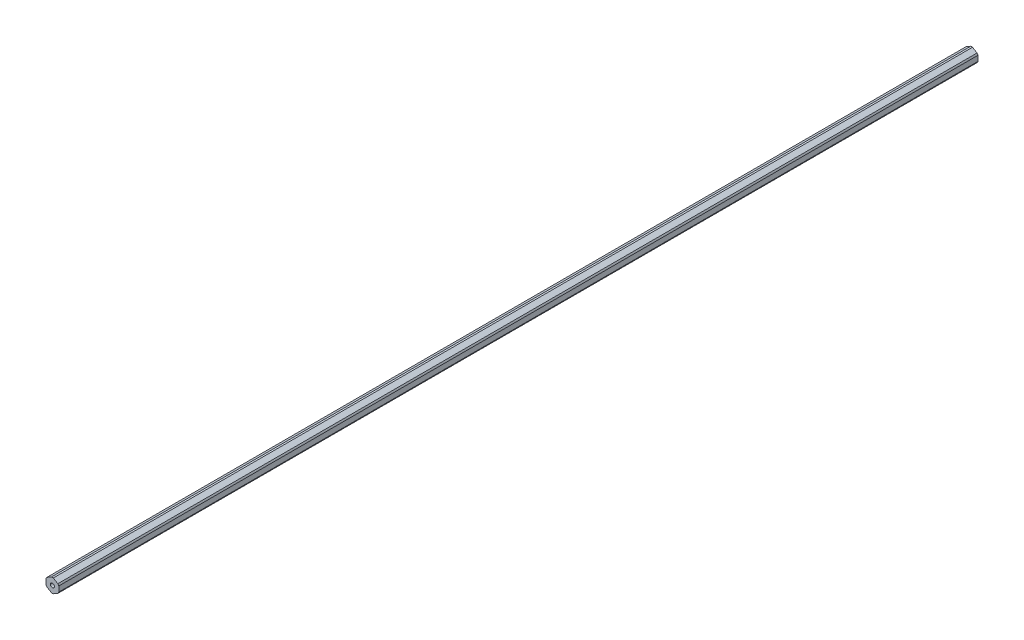
ISO-10303-21;
HEADER;
FILE_DESCRIPTION(('STEP AP214'),'2;1');
FILE_NAME('part.step','',(''),(''),'','','');
FILE_SCHEMA(('AUTOMOTIVE_DESIGN { 1 0 10303 214 1 1 1 1 }'));
ENDSEC;
DATA;
#1=APPLICATION_CONTEXT('core data for automotive mechanical design processes');
#2=APPLICATION_PROTOCOL_DEFINITION('international standard','automotive_design',2000,#1);
#3=PRODUCT_CONTEXT('',#1,'mechanical');
#4=PRODUCT('Part','Part','',(#3));
#5=PRODUCT_RELATED_PRODUCT_CATEGORY('part','',(#4));
#6=PRODUCT_DEFINITION_FORMATION('','',#4);
#7=PRODUCT_DEFINITION_CONTEXT('part definition',#1,'design');
#8=PRODUCT_DEFINITION('design','',#6,#7);
#9=PRODUCT_DEFINITION_SHAPE('','',#8);
#10=(LENGTH_UNIT() NAMED_UNIT(*) SI_UNIT(.MILLI.,.METRE.));
#11=(NAMED_UNIT(*) PLANE_ANGLE_UNIT() SI_UNIT($,.RADIAN.));
#12=(NAMED_UNIT(*) SI_UNIT($,.STERADIAN.) SOLID_ANGLE_UNIT());
#13=UNCERTAINTY_MEASURE_WITH_UNIT(LENGTH_MEASURE(1.E-05),#10,'distance_accuracy_value','');
#14=(GEOMETRIC_REPRESENTATION_CONTEXT(3) GLOBAL_UNCERTAINTY_ASSIGNED_CONTEXT((#13)) GLOBAL_UNIT_ASSIGNED_CONTEXT((#10,
#11,#12)) REPRESENTATION_CONTEXT('',''));
#15=CARTESIAN_POINT('',(0.,0.,0.));
#16=DIRECTION('',(0.,0.,1.));
#17=DIRECTION('',(1.,0.,0.));
#18=AXIS2_PLACEMENT_3D('',#15,#16,#17);
#19=CARTESIAN_POINT('',(0.,0.,-457.2));
#20=DIRECTION('',(0.,0.,1.));
#21=DIRECTION('',(1.,0.,0.));
#22=AXIS2_PLACEMENT_3D('',#19,#20,#21);
#23=PLANE('',#22);
#24=CARTESIAN_POINT('',(0.,0.,-457.2));
#25=DIRECTION('',(0.,0.,1.));
#26=DIRECTION('',(1.,0.,0.));
#27=AXIS2_PLACEMENT_3D('',#24,#25,#26);
#28=CIRCLE('',#27,2.0193);
#29=CARTESIAN_POINT('',(-2.0193,0.,-457.2));
#30=VERTEX_POINT('',#29);
#31=CARTESIAN_POINT('',(2.0193,0.,-457.2));
#32=VERTEX_POINT('',#31);
#33=EDGE_CURVE('E172',#30,#32,#28,.T.);
#34=ORIENTED_EDGE('',*,*,#33,.T.);
#35=CARTESIAN_POINT('',(0.,0.,-457.2));
#36=DIRECTION('',(0.,0.,1.));
#37=DIRECTION('',(1.,0.,0.));
#38=AXIS2_PLACEMENT_3D('',#35,#36,#37);
#39=CIRCLE('',#38,2.0193);
#40=EDGE_CURVE('E163',#32,#30,#39,.T.);
#41=ORIENTED_EDGE('',*,*,#40,.T.);
#42=EDGE_LOOP('',(#34,#41));
#43=FACE_BOUND('',#42,.T.);
#44=DIRECTION('',(0.,1.,0.));
#45=VECTOR('',#44,1.);
#46=CARTESIAN_POINT('',(6.345,0.,-457.2));
#47=LINE('',#46,#45);
#48=CARTESIAN_POINT('',(6.345,-2.63398462410091,-457.2));
#49=VERTEX_POINT('',#48);
#50=CARTESIAN_POINT('',(6.345,2.63398462410091,-457.2));
#51=VERTEX_POINT('',#50);
#52=EDGE_CURVE('E171',#49,#51,#47,.T.);
#53=ORIENTED_EDGE('',*,*,#52,.F.);
#54=CARTESIAN_POINT('',(0.,0.,-457.2));
#55=DIRECTION('',(0.,0.,1.));
#56=DIRECTION('',(1.,0.,0.));
#57=AXIS2_PLACEMENT_3D('',#54,#55,#56);
#58=CIRCLE('',#57,6.87);
#59=CARTESIAN_POINT('',(5.45359759764899,-4.17793887496181,-457.2));
#60=VERTEX_POINT('',#59);
#61=EDGE_CURVE('E26',#60,#49,#58,.T.);
#62=ORIENTED_EDGE('',*,*,#61,.F.);
#63=DIRECTION('',(0.866025403784439,0.5,0.));
#64=VECTOR('',#63,1.);
#65=CARTESIAN_POINT('',(3.1725,-5.49493118701227,-457.2));
#66=LINE('',#65,#64);
#67=CARTESIAN_POINT('',(0.891402402351008,-6.81192349906272,-457.2));
#68=VERTEX_POINT('',#67);
#69=EDGE_CURVE('E19',#68,#60,#66,.T.);
#70=ORIENTED_EDGE('',*,*,#69,.F.);
#71=CARTESIAN_POINT('',(0.,0.,-457.2));
#72=DIRECTION('',(0.,0.,1.));
#73=DIRECTION('',(1.,0.,0.));
#74=AXIS2_PLACEMENT_3D('',#71,#72,#73);
#75=CIRCLE('',#74,6.87);
#76=CARTESIAN_POINT('',(-0.891402402351014,-6.81192349906272,-457.2));
#77=VERTEX_POINT('',#76);
#78=EDGE_CURVE('E194',#77,#68,#75,.T.);
#79=ORIENTED_EDGE('',*,*,#78,.F.);
#80=DIRECTION('',(0.866025403784439,-0.5,0.));
#81=VECTOR('',#80,1.);
#82=CARTESIAN_POINT('',(-3.1725,-5.49493118701226,-457.2));
#83=LINE('',#82,#81);
#84=CARTESIAN_POINT('',(-5.45359759764899,-4.17793887496181,-457.2));
#85=VERTEX_POINT('',#84);
#86=EDGE_CURVE('E189',#85,#77,#83,.T.);
#87=ORIENTED_EDGE('',*,*,#86,.F.);
#88=CARTESIAN_POINT('',(0.,0.,-457.2));
#89=DIRECTION('',(0.,0.,1.));
#90=DIRECTION('',(1.,0.,0.));
#91=AXIS2_PLACEMENT_3D('',#88,#89,#90);
#92=CIRCLE('',#91,6.87);
#93=CARTESIAN_POINT('',(-6.345,-2.63398462410091,-457.2));
#94=VERTEX_POINT('',#93);
#95=EDGE_CURVE('E185',#94,#85,#92,.T.);
#96=ORIENTED_EDGE('',*,*,#95,.F.);
#97=DIRECTION('',(0.,-1.,0.));
#98=VECTOR('',#97,1.);
#99=CARTESIAN_POINT('',(-6.345,0.,-457.2));
#100=LINE('',#99,#98);
#101=CARTESIAN_POINT('',(-6.345,2.63398462410091,-457.2));
#102=VERTEX_POINT('',#101);
#103=EDGE_CURVE('E226',#102,#94,#100,.T.);
#104=ORIENTED_EDGE('',*,*,#103,.F.);
#105=CARTESIAN_POINT('',(0.,0.,-457.2));
#106=DIRECTION('',(0.,0.,1.));
#107=DIRECTION('',(1.,0.,0.));
#108=AXIS2_PLACEMENT_3D('',#105,#106,#107);
#109=CIRCLE('',#108,6.87);
#110=CARTESIAN_POINT('',(-5.45359759764899,4.17793887496182,-457.2));
#111=VERTEX_POINT('',#110);
#112=EDGE_CURVE('E225',#111,#102,#109,.T.);
#113=ORIENTED_EDGE('',*,*,#112,.F.);
#114=DIRECTION('',(-0.866025403784439,-0.5,0.));
#115=VECTOR('',#114,1.);
#116=CARTESIAN_POINT('',(-3.1725,5.49493118701227,-457.2));
#117=LINE('',#116,#115);
#118=CARTESIAN_POINT('',(-0.891402402351017,6.81192349906272,-457.2));
#119=VERTEX_POINT('',#118);
#120=EDGE_CURVE('E138',#119,#111,#117,.T.);
#121=ORIENTED_EDGE('',*,*,#120,.F.);
#122=CARTESIAN_POINT('',(0.,0.,-457.2));
#123=DIRECTION('',(0.,0.,1.));
#124=DIRECTION('',(1.,0.,0.));
#125=AXIS2_PLACEMENT_3D('',#122,#123,#124);
#126=CIRCLE('',#125,6.87);
#127=CARTESIAN_POINT('',(0.891402402351022,6.81192349906272,-457.2));
#128=VERTEX_POINT('',#127);
#129=EDGE_CURVE('E149',#128,#119,#126,.T.);
#130=ORIENTED_EDGE('',*,*,#129,.F.);
#131=DIRECTION('',(-0.866025403784439,0.5,0.));
#132=VECTOR('',#131,1.);
#133=CARTESIAN_POINT('',(3.1725,5.49493118701227,-457.2));
#134=LINE('',#133,#132);
#135=CARTESIAN_POINT('',(5.45359759764898,4.17793887496182,-457.2));
#136=VERTEX_POINT('',#135);
#137=EDGE_CURVE('E152',#136,#128,#134,.T.);
#138=ORIENTED_EDGE('',*,*,#137,.F.);
#139=CARTESIAN_POINT('',(0.,0.,-457.2));
#140=DIRECTION('',(0.,0.,1.));
#141=DIRECTION('',(1.,0.,0.));
#142=AXIS2_PLACEMENT_3D('',#139,#140,#141);
#143=CIRCLE('',#142,6.87);
#144=EDGE_CURVE('E219',#51,#136,#143,.T.);
#145=ORIENTED_EDGE('',*,*,#144,.F.);
#146=EDGE_LOOP('',(#53,#62,#70,#79,#87,#96,#104,#113,#121,#130,#138,#145));
#147=FACE_BOUND('',#146,.T.);
#148=ADVANCED_FACE('F15',(#43,#147),#23,.F.);
#149=CARTESIAN_POINT('',(0.,0.,457.2));
#150=DIRECTION('',(0.,0.,1.));
#151=DIRECTION('',(1.,0.,0.));
#152=AXIS2_PLACEMENT_3D('',#149,#150,#151);
#153=PLANE('',#152);
#154=CARTESIAN_POINT('',(0.,0.,457.2));
#155=DIRECTION('',(0.,0.,1.));
#156=DIRECTION('',(1.,0.,0.));
#157=AXIS2_PLACEMENT_3D('',#154,#155,#156);
#158=CIRCLE('',#157,2.0193);
#159=CARTESIAN_POINT('',(-2.0193,0.,457.2));
#160=VERTEX_POINT('',#159);
#161=CARTESIAN_POINT('',(2.0193,0.,457.2));
#162=VERTEX_POINT('',#161);
#163=EDGE_CURVE('E175',#160,#162,#158,.T.);
#164=ORIENTED_EDGE('',*,*,#163,.F.);
#165=CARTESIAN_POINT('',(0.,0.,457.2));
#166=DIRECTION('',(0.,0.,1.));
#167=DIRECTION('',(1.,0.,0.));
#168=AXIS2_PLACEMENT_3D('',#165,#166,#167);
#169=CIRCLE('',#168,2.0193);
#170=EDGE_CURVE('E303',#162,#160,#169,.T.);
#171=ORIENTED_EDGE('',*,*,#170,.F.);
#172=EDGE_LOOP('',(#164,#171));
#173=FACE_BOUND('',#172,.T.);
#174=DIRECTION('',(0.,1.,0.));
#175=VECTOR('',#174,1.);
#176=CARTESIAN_POINT('',(6.345,0.,457.2));
#177=LINE('',#176,#175);
#178=CARTESIAN_POINT('',(6.345,-2.63398462410091,457.2));
#179=VERTEX_POINT('',#178);
#180=CARTESIAN_POINT('',(6.345,2.63398462410091,457.2));
#181=VERTEX_POINT('',#180);
#182=EDGE_CURVE('E211',#179,#181,#177,.T.);
#183=ORIENTED_EDGE('',*,*,#182,.T.);
#184=CARTESIAN_POINT('',(0.,0.,457.2));
#185=DIRECTION('',(0.,0.,1.));
#186=DIRECTION('',(1.,0.,0.));
#187=AXIS2_PLACEMENT_3D('',#184,#185,#186);
#188=CIRCLE('',#187,6.87);
#189=CARTESIAN_POINT('',(5.45359759764898,4.17793887496182,457.2));
#190=VERTEX_POINT('',#189);
#191=EDGE_CURVE('E144',#181,#190,#188,.T.);
#192=ORIENTED_EDGE('',*,*,#191,.T.);
#193=DIRECTION('',(-0.866025403784439,0.5,0.));
#194=VECTOR('',#193,1.);
#195=CARTESIAN_POINT('',(3.1725,5.49493118701227,457.2));
#196=LINE('',#195,#194);
#197=CARTESIAN_POINT('',(0.891402402351022,6.81192349906272,457.2));
#198=VERTEX_POINT('',#197);
#199=EDGE_CURVE('E141',#190,#198,#196,.T.);
#200=ORIENTED_EDGE('',*,*,#199,.T.);
#201=CARTESIAN_POINT('',(0.,0.,457.2));
#202=DIRECTION('',(0.,0.,1.));
#203=DIRECTION('',(1.,0.,0.));
#204=AXIS2_PLACEMENT_3D('',#201,#202,#203);
#205=CIRCLE('',#204,6.87);
#206=CARTESIAN_POINT('',(-0.891402402351017,6.81192349906272,457.2));
#207=VERTEX_POINT('',#206);
#208=EDGE_CURVE('E126',#198,#207,#205,.T.);
#209=ORIENTED_EDGE('',*,*,#208,.T.);
#210=DIRECTION('',(-0.866025403784439,-0.5,0.));
#211=VECTOR('',#210,1.);
#212=CARTESIAN_POINT('',(-3.1725,5.49493118701227,457.2));
#213=LINE('',#212,#211);
#214=CARTESIAN_POINT('',(-5.45359759764899,4.17793887496182,457.2));
#215=VERTEX_POINT('',#214);
#216=EDGE_CURVE('E243',#207,#215,#213,.T.);
#217=ORIENTED_EDGE('',*,*,#216,.T.);
#218=CARTESIAN_POINT('',(0.,0.,457.2));
#219=DIRECTION('',(0.,0.,1.));
#220=DIRECTION('',(1.,0.,0.));
#221=AXIS2_PLACEMENT_3D('',#218,#219,#220);
#222=CIRCLE('',#221,6.87);
#223=CARTESIAN_POINT('',(-6.345,2.63398462410091,457.2));
#224=VERTEX_POINT('',#223);
#225=EDGE_CURVE('E224',#215,#224,#222,.T.);
#226=ORIENTED_EDGE('',*,*,#225,.T.);
#227=DIRECTION('',(0.,-1.,0.));
#228=VECTOR('',#227,1.);
#229=CARTESIAN_POINT('',(-6.345,0.,457.2));
#230=LINE('',#229,#228);
#231=CARTESIAN_POINT('',(-6.345,-2.63398462410091,457.2));
#232=VERTEX_POINT('',#231);
#233=EDGE_CURVE('E203',#224,#232,#230,.T.);
#234=ORIENTED_EDGE('',*,*,#233,.T.);
#235=CARTESIAN_POINT('',(0.,0.,457.2));
#236=DIRECTION('',(0.,0.,1.));
#237=DIRECTION('',(1.,0.,0.));
#238=AXIS2_PLACEMENT_3D('',#235,#236,#237);
#239=CIRCLE('',#238,6.87);
#240=CARTESIAN_POINT('',(-5.45359759764899,-4.17793887496181,457.2));
#241=VERTEX_POINT('',#240);
#242=EDGE_CURVE('E184',#232,#241,#239,.T.);
#243=ORIENTED_EDGE('',*,*,#242,.T.);
#244=DIRECTION('',(0.866025403784439,-0.5,0.));
#245=VECTOR('',#244,1.);
#246=CARTESIAN_POINT('',(-3.1725,-5.49493118701226,457.2));
#247=LINE('',#246,#245);
#248=CARTESIAN_POINT('',(-0.891402402351014,-6.81192349906272,457.2));
#249=VERTEX_POINT('',#248);
#250=EDGE_CURVE('E198',#241,#249,#247,.T.);
#251=ORIENTED_EDGE('',*,*,#250,.T.);
#252=CARTESIAN_POINT('',(0.,0.,457.2));
#253=DIRECTION('',(0.,0.,1.));
#254=DIRECTION('',(1.,0.,0.));
#255=AXIS2_PLACEMENT_3D('',#252,#253,#254);
#256=CIRCLE('',#255,6.87);
#257=CARTESIAN_POINT('',(0.891402402351008,-6.81192349906272,457.2));
#258=VERTEX_POINT('',#257);
#259=EDGE_CURVE('E237',#249,#258,#256,.T.);
#260=ORIENTED_EDGE('',*,*,#259,.T.);
#261=DIRECTION('',(0.866025403784439,0.5,0.));
#262=VECTOR('',#261,1.);
#263=CARTESIAN_POINT('',(3.1725,-5.49493118701227,457.2));
#264=LINE('',#263,#262);
#265=CARTESIAN_POINT('',(5.45359759764899,-4.17793887496181,457.2));
#266=VERTEX_POINT('',#265);
#267=EDGE_CURVE('E253',#258,#266,#264,.T.);
#268=ORIENTED_EDGE('',*,*,#267,.T.);
#269=CARTESIAN_POINT('',(0.,0.,457.2));
#270=DIRECTION('',(0.,0.,1.));
#271=DIRECTION('',(1.,0.,0.));
#272=AXIS2_PLACEMENT_3D('',#269,#270,#271);
#273=CIRCLE('',#272,6.87);
#274=EDGE_CURVE('E9',#266,#179,#273,.T.);
#275=ORIENTED_EDGE('',*,*,#274,.T.);
#276=EDGE_LOOP('',(#183,#192,#200,#209,#217,#226,#234,#243,#251,#260,#268,#275));
#277=FACE_BOUND('',#276,.T.);
#278=ADVANCED_FACE('F143',(#173,#277),#153,.T.);
#279=CARTESIAN_POINT('',(0.,0.,457.2));
#280=DIRECTION('',(0.,0.,-1.));
#281=DIRECTION('',(-1.,0.,0.));
#282=AXIS2_PLACEMENT_3D('',#279,#280,#281);
#283=CYLINDRICAL_SURFACE('',#282,6.87);
#284=ORIENTED_EDGE('',*,*,#61,.T.);
#285=DIRECTION('',(0.,0.,-1.));
#286=VECTOR('',#285,1.);
#287=CARTESIAN_POINT('',(6.345,-2.63398462410091,457.2));
#288=LINE('',#287,#286);
#289=EDGE_CURVE('E214',#179,#49,#288,.T.);
#290=ORIENTED_EDGE('',*,*,#289,.F.);
#291=ORIENTED_EDGE('',*,*,#274,.F.);
#292=DIRECTION('',(0.,0.,-1.));
#293=VECTOR('',#292,1.);
#294=CARTESIAN_POINT('',(5.45359759764899,-4.17793887496181,457.2));
#295=LINE('',#294,#293);
#296=EDGE_CURVE('E250',#266,#60,#295,.T.);
#297=ORIENTED_EDGE('',*,*,#296,.T.);
#298=EDGE_LOOP('',(#284,#290,#291,#297));
#299=FACE_BOUND('',#298,.T.);
#300=ADVANCED_FACE('F449',(#299),#283,.T.);
#301=CARTESIAN_POINT('',(0.,0.,457.2));
#302=DIRECTION('',(0.,0.,-1.));
#303=DIRECTION('',(-1.,0.,0.));
#304=AXIS2_PLACEMENT_3D('',#301,#302,#303);
#305=CYLINDRICAL_SURFACE('',#304,2.0193);
#306=DIRECTION('',(0.,0.,-1.));
#307=VECTOR('',#306,1.);
#308=CARTESIAN_POINT('',(2.0193,0.,457.2));
#309=LINE('',#308,#307);
#310=EDGE_CURVE('E179',#162,#32,#309,.T.);
#311=ORIENTED_EDGE('',*,*,#310,.F.);
#312=ORIENTED_EDGE('',*,*,#170,.T.);
#313=DIRECTION('',(0.,0.,-1.));
#314=VECTOR('',#313,1.);
#315=CARTESIAN_POINT('',(-2.0193,0.,457.2));
#316=LINE('',#315,#314);
#317=EDGE_CURVE('E167',#160,#30,#316,.T.);
#318=ORIENTED_EDGE('',*,*,#317,.T.);
#319=ORIENTED_EDGE('',*,*,#40,.F.);
#320=EDGE_LOOP('',(#311,#312,#318,#319));
#321=FACE_BOUND('',#320,.T.);
#322=ADVANCED_FACE('F337',(#321),#305,.F.);
#323=CARTESIAN_POINT('',(3.1725,-5.49493118701227,457.2));
#324=DIRECTION('',(-0.5,0.866025403784439,0.));
#325=DIRECTION('',(0.,0.,1.));
#326=AXIS2_PLACEMENT_3D('',#323,#324,#325);
#327=PLANE('',#326);
#328=ORIENTED_EDGE('',*,*,#69,.T.);
#329=ORIENTED_EDGE('',*,*,#296,.F.);
#330=ORIENTED_EDGE('',*,*,#267,.F.);
#331=DIRECTION('',(0.,0.,-1.));
#332=VECTOR('',#331,1.);
#333=CARTESIAN_POINT('',(0.891402402351008,-6.81192349906272,457.2));
#334=LINE('',#333,#332);
#335=EDGE_CURVE('E197',#258,#68,#334,.T.);
#336=ORIENTED_EDGE('',*,*,#335,.T.);
#337=EDGE_LOOP('',(#328,#329,#330,#336));
#338=FACE_BOUND('',#337,.T.);
#339=ADVANCED_FACE('F301',(#338),#327,.F.);
#340=CARTESIAN_POINT('',(0.,0.,457.2));
#341=DIRECTION('',(0.,0.,-1.));
#342=DIRECTION('',(-1.,0.,0.));
#343=AXIS2_PLACEMENT_3D('',#340,#341,#342);
#344=CYLINDRICAL_SURFACE('',#343,6.87);
#345=ORIENTED_EDGE('',*,*,#78,.T.);
#346=ORIENTED_EDGE('',*,*,#335,.F.);
#347=ORIENTED_EDGE('',*,*,#259,.F.);
#348=DIRECTION('',(0.,0.,-1.));
#349=VECTOR('',#348,1.);
#350=CARTESIAN_POINT('',(-0.891402402351014,-6.81192349906272,457.2));
#351=LINE('',#350,#349);
#352=EDGE_CURVE('E193',#249,#77,#351,.T.);
#353=ORIENTED_EDGE('',*,*,#352,.T.);
#354=EDGE_LOOP('',(#345,#346,#347,#353));
#355=FACE_BOUND('',#354,.T.);
#356=ADVANCED_FACE('F17',(#355),#344,.T.);
#357=CARTESIAN_POINT('',(-3.1725,-5.49493118701226,457.2));
#358=DIRECTION('',(0.5,0.866025403784439,0.));
#359=DIRECTION('',(0.,0.,-1.));
#360=AXIS2_PLACEMENT_3D('',#357,#358,#359);
#361=PLANE('',#360);
#362=ORIENTED_EDGE('',*,*,#86,.T.);
#363=ORIENTED_EDGE('',*,*,#352,.F.);
#364=ORIENTED_EDGE('',*,*,#250,.F.);
#365=DIRECTION('',(0.,0.,-1.));
#366=VECTOR('',#365,1.);
#367=CARTESIAN_POINT('',(-5.45359759764899,-4.17793887496181,457.2));
#368=LINE('',#367,#366);
#369=EDGE_CURVE('E180',#241,#85,#368,.T.);
#370=ORIENTED_EDGE('',*,*,#369,.T.);
#371=EDGE_LOOP('',(#362,#363,#364,#370));
#372=FACE_BOUND('',#371,.T.);
#373=ADVANCED_FACE('F274',(#372),#361,.F.);
#374=CARTESIAN_POINT('',(0.,0.,457.2));
#375=DIRECTION('',(0.,0.,-1.));
#376=DIRECTION('',(-1.,0.,0.));
#377=AXIS2_PLACEMENT_3D('',#374,#375,#376);
#378=CYLINDRICAL_SURFACE('',#377,6.87);
#379=ORIENTED_EDGE('',*,*,#95,.T.);
#380=ORIENTED_EDGE('',*,*,#369,.F.);
#381=ORIENTED_EDGE('',*,*,#242,.F.);
#382=DIRECTION('',(0.,0.,-1.));
#383=VECTOR('',#382,1.);
#384=CARTESIAN_POINT('',(-6.345,-2.63398462410091,457.2));
#385=LINE('',#384,#383);
#386=EDGE_CURVE('E207',#232,#94,#385,.T.);
#387=ORIENTED_EDGE('',*,*,#386,.T.);
#388=EDGE_LOOP('',(#379,#380,#381,#387));
#389=FACE_BOUND('',#388,.T.);
#390=ADVANCED_FACE('F462',(#389),#378,.T.);
#391=CARTESIAN_POINT('',(-6.345,0.,457.2));
#392=DIRECTION('',(1.,0.,0.));
#393=DIRECTION('',(0.,1.,0.));
#394=AXIS2_PLACEMENT_3D('',#391,#392,#393);
#395=PLANE('',#394);
#396=ORIENTED_EDGE('',*,*,#103,.T.);
#397=ORIENTED_EDGE('',*,*,#386,.F.);
#398=ORIENTED_EDGE('',*,*,#233,.F.);
#399=DIRECTION('',(0.,0.,-1.));
#400=VECTOR('',#399,1.);
#401=CARTESIAN_POINT('',(-6.345,2.63398462410091,457.2));
#402=LINE('',#401,#400);
#403=EDGE_CURVE('E220',#224,#102,#402,.T.);
#404=ORIENTED_EDGE('',*,*,#403,.T.);
#405=EDGE_LOOP('',(#396,#397,#398,#404));
#406=FACE_BOUND('',#405,.T.);
#407=ADVANCED_FACE('F466',(#406),#395,.F.);
#408=CARTESIAN_POINT('',(0.,0.,457.2));
#409=DIRECTION('',(0.,0.,-1.));
#410=DIRECTION('',(-1.,0.,0.));
#411=AXIS2_PLACEMENT_3D('',#408,#409,#410);
#412=CYLINDRICAL_SURFACE('',#411,6.87);
#413=ORIENTED_EDGE('',*,*,#112,.T.);
#414=ORIENTED_EDGE('',*,*,#403,.F.);
#415=ORIENTED_EDGE('',*,*,#225,.F.);
#416=DIRECTION('',(0.,0.,-1.));
#417=VECTOR('',#416,1.);
#418=CARTESIAN_POINT('',(-5.45359759764899,4.17793887496182,457.2));
#419=LINE('',#418,#417);
#420=EDGE_CURVE('E233',#215,#111,#419,.T.);
#421=ORIENTED_EDGE('',*,*,#420,.T.);
#422=EDGE_LOOP('',(#413,#414,#415,#421));
#423=FACE_BOUND('',#422,.T.);
#424=ADVANCED_FACE('F472',(#423),#412,.T.);
#425=CARTESIAN_POINT('',(-3.1725,5.49493118701227,457.2));
#426=DIRECTION('',(0.5,-0.866025403784439,0.));
#427=DIRECTION('',(0.,0.,-1.));
#428=AXIS2_PLACEMENT_3D('',#425,#426,#427);
#429=PLANE('',#428);
#430=ORIENTED_EDGE('',*,*,#120,.T.);
#431=ORIENTED_EDGE('',*,*,#420,.F.);
#432=ORIENTED_EDGE('',*,*,#216,.F.);
#433=DIRECTION('',(0.,0.,-1.));
#434=VECTOR('',#433,1.);
#435=CARTESIAN_POINT('',(-0.891402402351017,6.81192349906272,457.2));
#436=LINE('',#435,#434);
#437=EDGE_CURVE('E134',#207,#119,#436,.T.);
#438=ORIENTED_EDGE('',*,*,#437,.T.);
#439=EDGE_LOOP('',(#430,#431,#432,#438));
#440=FACE_BOUND('',#439,.T.);
#441=ADVANCED_FACE('F476',(#440),#429,.F.);
#442=CARTESIAN_POINT('',(0.,0.,457.2));
#443=DIRECTION('',(0.,0.,-1.));
#444=DIRECTION('',(-1.,0.,0.));
#445=AXIS2_PLACEMENT_3D('',#442,#443,#444);
#446=CYLINDRICAL_SURFACE('',#445,6.87);
#447=ORIENTED_EDGE('',*,*,#129,.T.);
#448=ORIENTED_EDGE('',*,*,#437,.F.);
#449=ORIENTED_EDGE('',*,*,#208,.F.);
#450=DIRECTION('',(0.,0.,-1.));
#451=VECTOR('',#450,1.);
#452=CARTESIAN_POINT('',(0.891402402351022,6.81192349906272,457.2));
#453=LINE('',#452,#451);
#454=EDGE_CURVE('E131',#198,#128,#453,.T.);
#455=ORIENTED_EDGE('',*,*,#454,.T.);
#456=EDGE_LOOP('',(#447,#448,#449,#455));
#457=FACE_BOUND('',#456,.T.);
#458=ADVANCED_FACE('F129',(#457),#446,.T.);
#459=CARTESIAN_POINT('',(3.1725,5.49493118701227,457.2));
#460=DIRECTION('',(-0.5,-0.866025403784439,0.));
#461=DIRECTION('',(-0.866025403784439,0.5,0.));
#462=AXIS2_PLACEMENT_3D('',#459,#460,#461);
#463=PLANE('',#462);
#464=ORIENTED_EDGE('',*,*,#137,.T.);
#465=ORIENTED_EDGE('',*,*,#454,.F.);
#466=ORIENTED_EDGE('',*,*,#199,.F.);
#467=DIRECTION('',(0.,0.,-1.));
#468=VECTOR('',#467,1.);
#469=CARTESIAN_POINT('',(5.45359759764898,4.17793887496182,457.2));
#470=LINE('',#469,#468);
#471=EDGE_CURVE('E165',#190,#136,#470,.T.);
#472=ORIENTED_EDGE('',*,*,#471,.T.);
#473=EDGE_LOOP('',(#464,#465,#466,#472));
#474=FACE_BOUND('',#473,.T.);
#475=ADVANCED_FACE('F151',(#474),#463,.F.);
#476=CARTESIAN_POINT('',(0.,0.,457.2));
#477=DIRECTION('',(0.,0.,-1.));
#478=DIRECTION('',(-1.,0.,0.));
#479=AXIS2_PLACEMENT_3D('',#476,#477,#478);
#480=CYLINDRICAL_SURFACE('',#479,6.87);
#481=ORIENTED_EDGE('',*,*,#144,.T.);
#482=ORIENTED_EDGE('',*,*,#471,.F.);
#483=ORIENTED_EDGE('',*,*,#191,.F.);
#484=DIRECTION('',(0.,0.,-1.));
#485=VECTOR('',#484,1.);
#486=CARTESIAN_POINT('',(6.345,2.63398462410091,457.2));
#487=LINE('',#486,#485);
#488=EDGE_CURVE('E215',#181,#51,#487,.T.);
#489=ORIENTED_EDGE('',*,*,#488,.T.);
#490=EDGE_LOOP('',(#481,#482,#483,#489));
#491=FACE_BOUND('',#490,.T.);
#492=ADVANCED_FACE('F489',(#491),#480,.T.);
#493=CARTESIAN_POINT('',(6.345,0.,457.2));
#494=DIRECTION('',(-1.,0.,0.));
#495=DIRECTION('',(0.,1.,0.));
#496=AXIS2_PLACEMENT_3D('',#493,#494,#495);
#497=PLANE('',#496);
#498=ORIENTED_EDGE('',*,*,#52,.T.);
#499=ORIENTED_EDGE('',*,*,#488,.F.);
#500=ORIENTED_EDGE('',*,*,#182,.F.);
#501=ORIENTED_EDGE('',*,*,#289,.T.);
#502=EDGE_LOOP('',(#498,#499,#500,#501));
#503=FACE_BOUND('',#502,.T.);
#504=ADVANCED_FACE('F493',(#503),#497,.F.);
#505=CARTESIAN_POINT('',(0.,0.,457.2));
#506=DIRECTION('',(0.,0.,-1.));
#507=DIRECTION('',(-1.,0.,0.));
#508=AXIS2_PLACEMENT_3D('',#505,#506,#507);
#509=CYLINDRICAL_SURFACE('',#508,2.0193);
#510=ORIENTED_EDGE('',*,*,#163,.T.);
#511=ORIENTED_EDGE('',*,*,#310,.T.);
#512=ORIENTED_EDGE('',*,*,#33,.F.);
#513=ORIENTED_EDGE('',*,*,#317,.F.);
#514=EDGE_LOOP('',(#510,#511,#512,#513));
#515=FACE_BOUND('',#514,.T.);
#516=ADVANCED_FACE('F334',(#515),#509,.F.);
#517=CLOSED_SHELL('',(#148,#278,#300,#322,#339,#356,#373,#390,#407,#424,#441,#458,#475,#492,
#504,#516));
#518=MANIFOLD_SOLID_BREP('B1',#517);
#519=ADVANCED_BREP_SHAPE_REPRESENTATION('',(#18,#518),#14);
#520=SHAPE_DEFINITION_REPRESENTATION(#9,#519);
ENDSEC;
END-ISO-10303-21;
